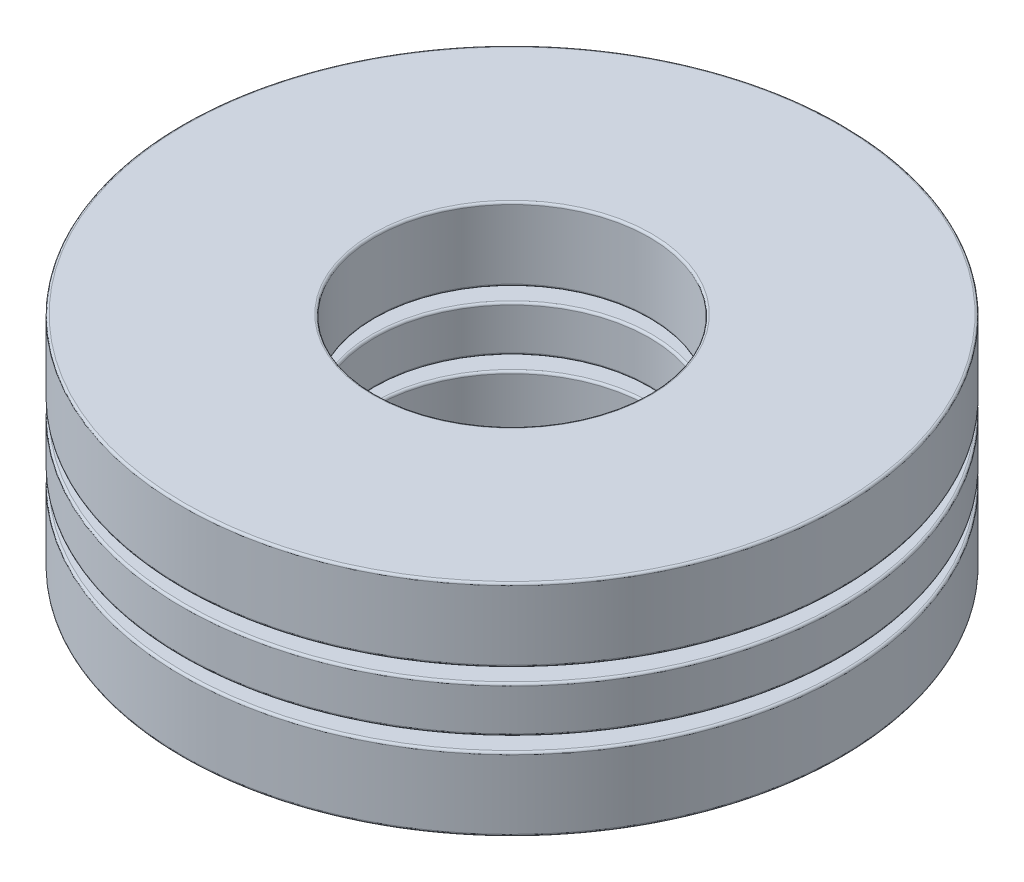
ISO-10303-21;
HEADER;
FILE_DESCRIPTION(('STEP AP214'),'2;1');
FILE_NAME('part.step','',(''),(''),'','','');
FILE_SCHEMA(('AUTOMOTIVE_DESIGN { 1 0 10303 214 1 1 1 1 }'));
ENDSEC;
DATA;
#1=APPLICATION_CONTEXT('core data for automotive mechanical design processes');
#2=APPLICATION_PROTOCOL_DEFINITION('international standard','automotive_design',2000,#1);
#3=PRODUCT_CONTEXT('',#1,'mechanical');
#4=PRODUCT('Part','Part','',(#3));
#5=PRODUCT_RELATED_PRODUCT_CATEGORY('part','',(#4));
#6=PRODUCT_DEFINITION_FORMATION('','',#4);
#7=PRODUCT_DEFINITION_CONTEXT('part definition',#1,'design');
#8=PRODUCT_DEFINITION('design','',#6,#7);
#9=PRODUCT_DEFINITION_SHAPE('','',#8);
#10=(LENGTH_UNIT() NAMED_UNIT(*) SI_UNIT(.MILLI.,.METRE.));
#11=(NAMED_UNIT(*) PLANE_ANGLE_UNIT() SI_UNIT($,.RADIAN.));
#12=(NAMED_UNIT(*) SI_UNIT($,.STERADIAN.) SOLID_ANGLE_UNIT());
#13=UNCERTAINTY_MEASURE_WITH_UNIT(LENGTH_MEASURE(1.E-05),#10,'distance_accuracy_value','');
#14=(GEOMETRIC_REPRESENTATION_CONTEXT(3) GLOBAL_UNCERTAINTY_ASSIGNED_CONTEXT((#13)) GLOBAL_UNIT_ASSIGNED_CONTEXT((#10,
#11,#12)) REPRESENTATION_CONTEXT('',''));
#15=CARTESIAN_POINT('',(0.,0.,0.));
#16=DIRECTION('',(0.,0.,1.));
#17=DIRECTION('',(1.,0.,0.));
#18=AXIS2_PLACEMENT_3D('',#15,#16,#17);
#19=CARTESIAN_POINT('',(-3.6806079660839,0.66666666708388,-2.12499999999994));
#20=CARTESIAN_POINT('',(-2.52590742712729,0.66666666708388,-1.45833333299996));
#21=CARTESIAN_POINT('',(-2.52590742712729,-0.666666666916121,-1.45833333299996));
#22=CARTESIAN_POINT('',(-3.6806079660839,-0.666666666916121,-2.12499999999994));
#23=(BOUNDED_CURVE() B_SPLINE_CURVE(3,(#19,#20,#21,#22),.UNSPECIFIED.,.F.,
.F.) B_SPLINE_CURVE_WITH_KNOTS((4,4),(0.,1.),
.UNSPECIFIED.) CURVE() GEOMETRIC_REPRESENTATION_ITEM() RATIONAL_B_SPLINE_CURVE((1.,
0.333333333333333,0.333333333333333,1.)) REPRESENTATION_ITEM(''));
#24=CARTESIAN_POINT('',(-3.680607966,0.,-2.125));
#25=DIRECTION('',(0.,1.,0.));
#26=AXIS1_PLACEMENT('',#24,#25);
#27=SURFACE_OF_REVOLUTION('',#23,#26);
#28=CARTESIAN_POINT('',(-3.680607966,-0.666666666916121,-2.125));
#29=VERTEX_POINT('',#28);
#30=VERTEX_LOOP('',#29);
#31=FACE_BOUND('',#30,.T.);
#32=CARTESIAN_POINT('',(-3.680607966,0.66666666708388,-2.125));
#33=VERTEX_POINT('',#32);
#34=VERTEX_LOOP('',#33);
#35=FACE_BOUND('',#34,.T.);
#36=ADVANCED_FACE('P0_F15',(#31,#35),#27,.F.);
#37=CLOSED_SHELL('',(#36));
#38=MANIFOLD_SOLID_BREP('P0_B1',#37);
#39=CARTESIAN_POINT('',(3.68060796608386,0.66666666691614,-2.125));
#40=CARTESIAN_POINT('',(2.52590742712726,0.66666666691614,-1.458333333));
#41=CARTESIAN_POINT('',(2.52590742712726,-0.666666667083859,-1.458333333));
#42=CARTESIAN_POINT('',(3.68060796608386,-0.666666667083859,-2.125));
#43=(BOUNDED_CURVE() B_SPLINE_CURVE(3,(#39,#40,#41,#42),.UNSPECIFIED.,.F.,
.F.) B_SPLINE_CURVE_WITH_KNOTS((4,4),(0.,1.),
.UNSPECIFIED.) CURVE() GEOMETRIC_REPRESENTATION_ITEM() RATIONAL_B_SPLINE_CURVE((1.,
0.333333333333333,0.333333333333333,1.)) REPRESENTATION_ITEM(''));
#44=CARTESIAN_POINT('',(3.680607966,0.,-2.125));
#45=DIRECTION('',(0.,1.,0.));
#46=AXIS1_PLACEMENT('',#44,#45);
#47=SURFACE_OF_REVOLUTION('',#43,#46);
#48=CARTESIAN_POINT('',(3.680607966,-0.666666667083859,-2.125));
#49=VERTEX_POINT('',#48);
#50=VERTEX_LOOP('',#49);
#51=FACE_BOUND('',#50,.T.);
#52=CARTESIAN_POINT('',(3.680607966,0.66666666691614,-2.125));
#53=VERTEX_POINT('',#52);
#54=VERTEX_LOOP('',#53);
#55=FACE_BOUND('',#54,.T.);
#56=ADVANCED_FACE('P1_F15',(#51,#55),#47,.F.);
#57=CLOSED_SHELL('',(#56));
#58=MANIFOLD_SOLID_BREP('P1_B1',#57);
#59=CARTESIAN_POINT('',(0.,0.666666667,4.25));
#60=CARTESIAN_POINT('',(0.,0.666666667,2.916666666));
#61=CARTESIAN_POINT('',(0.,-0.666666667,2.916666666));
#62=CARTESIAN_POINT('',(0.,-0.666666667,4.25));
#63=(BOUNDED_CURVE() B_SPLINE_CURVE(3,(#59,#60,#61,#62),.UNSPECIFIED.,.F.,
.F.) B_SPLINE_CURVE_WITH_KNOTS((4,4),(0.,1.),
.UNSPECIFIED.) CURVE() GEOMETRIC_REPRESENTATION_ITEM() RATIONAL_B_SPLINE_CURVE((1.,
0.333333333333333,0.333333333333333,1.)) REPRESENTATION_ITEM(''));
#64=CARTESIAN_POINT('',(0.,0.,4.25));
#65=DIRECTION('',(0.,1.,0.));
#66=AXIS1_PLACEMENT('',#64,#65);
#67=SURFACE_OF_REVOLUTION('',#63,#66);
#68=CARTESIAN_POINT('',(0.,-0.666666667,4.25));
#69=VERTEX_POINT('',#68);
#70=VERTEX_LOOP('',#69);
#71=FACE_BOUND('',#70,.T.);
#72=CARTESIAN_POINT('',(0.,0.666666667,4.25));
#73=VERTEX_POINT('',#72);
#74=VERTEX_LOOP('',#73);
#75=FACE_BOUND('',#74,.T.);
#76=ADVANCED_FACE('P2_F15',(#71,#75),#67,.F.);
#77=CLOSED_SHELL('',(#76));
#78=MANIFOLD_SOLID_BREP('P2_B1',#77);
#79=CARTESIAN_POINT('',(0.,-2.,2.54));
#80=CARTESIAN_POINT('',(0.,-2.,2.51656854249492));
#81=CARTESIAN_POINT('',(0.,-1.98343145750507,2.5));
#82=CARTESIAN_POINT('',(0.,-1.96,2.5));
#83=(BOUNDED_CURVE() B_SPLINE_CURVE(3,(#79,#80,#81,#82),.UNSPECIFIED.,.F.,
.F.) B_SPLINE_CURVE_WITH_KNOTS((4,4),(0.,1.),
.UNSPECIFIED.) CURVE() GEOMETRIC_REPRESENTATION_ITEM() RATIONAL_B_SPLINE_CURVE((1.,
0.804737854124367,0.804737854124367,1.)) REPRESENTATION_ITEM(''));
#84=CARTESIAN_POINT('',(0.,-1.96,0.));
#85=DIRECTION('',(0.,1.,0.));
#86=AXIS1_PLACEMENT('',#84,#85);
#87=SURFACE_OF_REVOLUTION('',#83,#86);
#88=CARTESIAN_POINT('',(0.,-1.96,0.));
#89=DIRECTION('',(0.,-1.,0.));
#90=DIRECTION('',(0.,0.,-1.));
#91=AXIS2_PLACEMENT_3D('',#88,#89,#90);
#92=CIRCLE('',#91,2.5);
#93=CARTESIAN_POINT('',(0.,-1.96,-2.5));
#94=VERTEX_POINT('',#93);
#95=EDGE_CURVE('P3_E221',#94,#94,#92,.T.);
#96=ORIENTED_EDGE('',*,*,#95,.F.);
#97=EDGE_LOOP('',(#96));
#98=FACE_BOUND('',#97,.T.);
#99=CARTESIAN_POINT('',(0.,-2.,0.));
#100=DIRECTION('',(0.,-1.,0.));
#101=DIRECTION('',(0.,0.,1.));
#102=AXIS2_PLACEMENT_3D('',#99,#100,#101);
#103=CIRCLE('',#102,2.54);
#104=CARTESIAN_POINT('',(0.,-2.,-2.54));
#105=VERTEX_POINT('',#104);
#106=CARTESIAN_POINT('',(0.,-2.,2.54));
#107=VERTEX_POINT('',#106);
#108=EDGE_CURVE('P3_E161',#105,#107,#103,.F.);
#109=ORIENTED_EDGE('',*,*,#108,.F.);
#110=CARTESIAN_POINT('',(0.,-2.,0.));
#111=DIRECTION('',(0.,-1.,0.));
#112=DIRECTION('',(0.,0.,-1.));
#113=AXIS2_PLACEMENT_3D('',#110,#111,#112);
#114=CIRCLE('',#113,2.54);
#115=EDGE_CURVE('P3_E152',#107,#105,#114,.F.);
#116=ORIENTED_EDGE('',*,*,#115,.F.);
#117=EDGE_LOOP('',(#109,#116));
#118=FACE_BOUND('',#117,.T.);
#119=ADVANCED_FACE('P3_F16',(#98,#118),#87,.F.);
#120=CARTESIAN_POINT('',(0.,-0.706666667,0.));
#121=DIRECTION('',(0.,-1.,0.));
#122=DIRECTION('',(0.,0.,-1.));
#123=AXIS2_PLACEMENT_3D('',#120,#121,#122);
#124=CYLINDRICAL_SURFACE('',#123,2.5);
#125=ORIENTED_EDGE('',*,*,#95,.T.);
#126=EDGE_LOOP('',(#125));
#127=FACE_BOUND('',#126,.T.);
#128=CARTESIAN_POINT('',(0.,-0.706666666666667,0.));
#129=DIRECTION('',(0.,-1.,0.));
#130=DIRECTION('',(0.,0.,-1.));
#131=AXIS2_PLACEMENT_3D('',#128,#129,#130);
#132=CIRCLE('',#131,2.50000000033333);
#133=CARTESIAN_POINT('',(0.,-0.706666666666667,-2.50000000033333));
#134=VERTEX_POINT('',#133);
#135=EDGE_CURVE('P3_E167',#134,#134,#132,.T.);
#136=ORIENTED_EDGE('',*,*,#135,.F.);
#137=EDGE_LOOP('',(#136));
#138=FACE_BOUND('',#137,.T.);
#139=ADVANCED_FACE('P3_F184',(#127,#138),#124,.F.);
#140=CARTESIAN_POINT('',(0.,-2.,6.));
#141=DIRECTION('',(0.,1.,0.));
#142=DIRECTION('',(0.,0.,1.));
#143=AXIS2_PLACEMENT_3D('',#140,#141,#142);
#144=PLANE('',#143);
#145=ORIENTED_EDGE('',*,*,#115,.T.);
#146=ORIENTED_EDGE('',*,*,#108,.T.);
#147=EDGE_LOOP('',(#145,#146));
#148=FACE_BOUND('',#147,.T.);
#149=CARTESIAN_POINT('',(0.,-2.,0.));
#150=DIRECTION('',(0.,1.,0.));
#151=DIRECTION('',(0.,0.,-1.));
#152=AXIS2_PLACEMENT_3D('',#149,#150,#151);
#153=CIRCLE('',#152,5.96);
#154=CARTESIAN_POINT('',(0.,-2.,5.96));
#155=VERTEX_POINT('',#154);
#156=CARTESIAN_POINT('',(0.,-2.,-5.96));
#157=VERTEX_POINT('',#156);
#158=EDGE_CURVE('P3_E55',#155,#157,#153,.F.);
#159=ORIENTED_EDGE('',*,*,#158,.T.);
#160=CARTESIAN_POINT('',(0.,-2.,0.));
#161=DIRECTION('',(0.,1.,0.));
#162=DIRECTION('',(0.,0.,1.));
#163=AXIS2_PLACEMENT_3D('',#160,#161,#162);
#164=CIRCLE('',#163,5.96);
#165=EDGE_CURVE('P3_E201',#155,#157,#164,.T.);
#166=ORIENTED_EDGE('',*,*,#165,.F.);
#167=EDGE_LOOP('',(#159,#166));
#168=FACE_BOUND('',#167,.T.);
#169=ADVANCED_FACE('P3_F166',(#148,#168),#144,.F.);
#170=CARTESIAN_POINT('',(0.,-0.666666666666667,-2.54000000033333));
#171=CARTESIAN_POINT('',(0.,-0.666666666666667,-2.51656854282825));
#172=CARTESIAN_POINT('',(0.,-0.683235209161591,-2.50000000033333));
#173=CARTESIAN_POINT('',(0.,-0.706666666666667,-2.50000000033333));
#174=(BOUNDED_CURVE() B_SPLINE_CURVE(3,(#170,#171,#172,#173),.UNSPECIFIED.,.F.,
.F.) B_SPLINE_CURVE_WITH_KNOTS((4,4),(0.,1.),
.UNSPECIFIED.) CURVE() GEOMETRIC_REPRESENTATION_ITEM() RATIONAL_B_SPLINE_CURVE((1.,
0.804737854124365,0.804737854124365,1.)) REPRESENTATION_ITEM(''));
#175=CARTESIAN_POINT('',(0.,-0.706666667,0.));
#176=DIRECTION('',(0.,-1.,0.));
#177=AXIS1_PLACEMENT('',#175,#176);
#178=SURFACE_OF_REVOLUTION('',#174,#177);
#179=ORIENTED_EDGE('',*,*,#135,.T.);
#180=EDGE_LOOP('',(#179));
#181=FACE_BOUND('',#180,.T.);
#182=CARTESIAN_POINT('',(0.,-0.666666666666667,0.));
#183=DIRECTION('',(0.,1.,0.));
#184=DIRECTION('',(0.,0.,-1.));
#185=AXIS2_PLACEMENT_3D('',#182,#183,#184);
#186=CIRCLE('',#185,2.54000000016666);
#187=CARTESIAN_POINT('',(0.,-0.6666666668,2.5400000001));
#188=VERTEX_POINT('',#187);
#189=CARTESIAN_POINT('',(0.,-0.6666666668,-2.5400000001));
#190=VERTEX_POINT('',#189);
#191=EDGE_CURVE('P3_E68',#188,#190,#186,.F.);
#192=ORIENTED_EDGE('',*,*,#191,.F.);
#193=CARTESIAN_POINT('',(0.,-0.666666666666667,0.));
#194=DIRECTION('',(0.,1.,0.));
#195=DIRECTION('',(0.,0.,1.));
#196=AXIS2_PLACEMENT_3D('',#193,#194,#195);
#197=CIRCLE('',#196,2.54000000016666);
#198=EDGE_CURVE('P3_E65',#190,#188,#197,.F.);
#199=ORIENTED_EDGE('',*,*,#198,.F.);
#200=EDGE_LOOP('',(#192,#199));
#201=FACE_BOUND('',#200,.T.);
#202=ADVANCED_FACE('P3_F70',(#181,#201),#178,.F.);
#203=CARTESIAN_POINT('',(0.,-1.96,6.));
#204=CARTESIAN_POINT('',(0.,-1.98343145750508,6.));
#205=CARTESIAN_POINT('',(0.,-2.,5.98343145750508));
#206=CARTESIAN_POINT('',(0.,-2.,5.96));
#207=(BOUNDED_CURVE() B_SPLINE_CURVE(3,(#203,#204,#205,#206),.UNSPECIFIED.,.F.,
.F.) B_SPLINE_CURVE_WITH_KNOTS((4,4),(0.,1.),
.UNSPECIFIED.) CURVE() GEOMETRIC_REPRESENTATION_ITEM() RATIONAL_B_SPLINE_CURVE((1.,
0.804737854124367,0.804737854124367,1.)) REPRESENTATION_ITEM(''));
#208=CARTESIAN_POINT('',(0.,-1.96,0.));
#209=DIRECTION('',(0.,1.,0.));
#210=AXIS1_PLACEMENT('',#208,#209);
#211=SURFACE_OF_REVOLUTION('',#207,#210);
#212=ORIENTED_EDGE('',*,*,#165,.T.);
#213=ORIENTED_EDGE('',*,*,#158,.F.);
#214=EDGE_LOOP('',(#212,#213));
#215=FACE_BOUND('',#214,.T.);
#216=CARTESIAN_POINT('',(0.,-1.96,0.));
#217=DIRECTION('',(0.,-1.,0.));
#218=DIRECTION('',(0.,0.,-1.));
#219=AXIS2_PLACEMENT_3D('',#216,#217,#218);
#220=CIRCLE('',#219,6.);
#221=CARTESIAN_POINT('',(0.,-1.96,-6.));
#222=VERTEX_POINT('',#221);
#223=EDGE_CURVE('P3_E73',#222,#222,#220,.F.);
#224=ORIENTED_EDGE('',*,*,#223,.F.);
#225=EDGE_LOOP('',(#224));
#226=FACE_BOUND('',#225,.T.);
#227=ADVANCED_FACE('P3_F96',(#215,#226),#211,.F.);
#228=CARTESIAN_POINT('',(0.,-0.666666667,6.));
#229=DIRECTION('',(0.,-1.,0.));
#230=DIRECTION('',(0.,0.,-1.));
#231=AXIS2_PLACEMENT_3D('',#228,#229,#230);
#232=PLANE('',#231);
#233=ORIENTED_EDGE('',*,*,#198,.T.);
#234=ORIENTED_EDGE('',*,*,#191,.T.);
#235=EDGE_LOOP('',(#233,#234));
#236=FACE_BOUND('',#235,.T.);
#237=CARTESIAN_POINT('',(0.,-0.666666667,0.));
#238=DIRECTION('',(0.,-1.,0.));
#239=DIRECTION('',(0.,0.,1.));
#240=AXIS2_PLACEMENT_3D('',#237,#238,#239);
#241=CIRCLE('',#240,5.96);
#242=CARTESIAN_POINT('',(0.,-0.666666667,-5.96));
#243=VERTEX_POINT('',#242);
#244=CARTESIAN_POINT('',(0.,-0.666666667,5.96));
#245=VERTEX_POINT('',#244);
#246=EDGE_CURVE('P3_E38',#243,#245,#241,.F.);
#247=ORIENTED_EDGE('',*,*,#246,.T.);
#248=CARTESIAN_POINT('',(0.,-0.666666667,0.));
#249=DIRECTION('',(0.,-1.,0.));
#250=DIRECTION('',(0.,0.,-1.));
#251=AXIS2_PLACEMENT_3D('',#248,#249,#250);
#252=CIRCLE('',#251,5.96);
#253=EDGE_CURVE('P3_E30',#243,#245,#252,.T.);
#254=ORIENTED_EDGE('',*,*,#253,.F.);
#255=EDGE_LOOP('',(#247,#254));
#256=FACE_BOUND('',#255,.T.);
#257=ADVANCED_FACE('P3_F77',(#236,#256),#232,.F.);
#258=CARTESIAN_POINT('',(0.,-1.96,0.));
#259=DIRECTION('',(0.,-1.,0.));
#260=DIRECTION('',(0.,0.,-1.));
#261=AXIS2_PLACEMENT_3D('',#258,#259,#260);
#262=CYLINDRICAL_SURFACE('',#261,6.);
#263=CARTESIAN_POINT('',(0.,-0.706666666666667,0.));
#264=DIRECTION('',(0.,-1.,0.));
#265=DIRECTION('',(0.,0.,-1.));
#266=AXIS2_PLACEMENT_3D('',#263,#264,#265);
#267=CIRCLE('',#266,6.);
#268=CARTESIAN_POINT('',(0.,-0.706666666666667,-6.));
#269=VERTEX_POINT('',#268);
#270=EDGE_CURVE('P3_E11',#269,#269,#267,.F.);
#271=ORIENTED_EDGE('',*,*,#270,.F.);
#272=EDGE_LOOP('',(#271));
#273=FACE_BOUND('',#272,.T.);
#274=ORIENTED_EDGE('',*,*,#223,.T.);
#275=EDGE_LOOP('',(#274));
#276=FACE_BOUND('',#275,.T.);
#277=ADVANCED_FACE('P3_F95',(#273,#276),#262,.T.);
#278=CARTESIAN_POINT('',(0.,-0.706666667,-6.));
#279=CARTESIAN_POINT('',(0.,-0.683235209494924,-6.));
#280=CARTESIAN_POINT('',(0.,-0.666666667,-5.98343145750508));
#281=CARTESIAN_POINT('',(0.,-0.666666667,-5.96));
#282=(BOUNDED_CURVE() B_SPLINE_CURVE(3,(#278,#279,#280,#281),.UNSPECIFIED.,.F.,
.F.) B_SPLINE_CURVE_WITH_KNOTS((4,4),(0.,1.),
.UNSPECIFIED.) CURVE() GEOMETRIC_REPRESENTATION_ITEM() RATIONAL_B_SPLINE_CURVE((1.,
0.804737854124365,0.804737854124365,1.)) REPRESENTATION_ITEM(''));
#283=CARTESIAN_POINT('',(0.,-0.706666667,0.));
#284=DIRECTION('',(0.,-1.,0.));
#285=AXIS1_PLACEMENT('',#283,#284);
#286=SURFACE_OF_REVOLUTION('',#282,#285);
#287=ORIENTED_EDGE('',*,*,#253,.T.);
#288=ORIENTED_EDGE('',*,*,#246,.F.);
#289=EDGE_LOOP('',(#287,#288));
#290=FACE_BOUND('',#289,.T.);
#291=ORIENTED_EDGE('',*,*,#270,.T.);
#292=EDGE_LOOP('',(#291));
#293=FACE_BOUND('',#292,.T.);
#294=ADVANCED_FACE('P3_F122',(#290,#293),#286,.F.);
#295=CLOSED_SHELL('',(#119,#139,#169,#202,#227,#257,#277,#294));
#296=MANIFOLD_SOLID_BREP('P3_B1',#295);
#297=CARTESIAN_POINT('',(0.,0.666666666666668,2.53999999966667));
#298=CARTESIAN_POINT('',(0.,0.666666666666668,2.51656854216159));
#299=CARTESIAN_POINT('',(0.,0.683235209161592,2.49999999966667));
#300=CARTESIAN_POINT('',(0.,0.706666666666668,2.49999999966667));
#301=(BOUNDED_CURVE() B_SPLINE_CURVE(3,(#297,#298,#299,#300),.UNSPECIFIED.,.F.,
.F.) B_SPLINE_CURVE_WITH_KNOTS((4,4),(0.,1.),
.UNSPECIFIED.) CURVE() GEOMETRIC_REPRESENTATION_ITEM() RATIONAL_B_SPLINE_CURVE((1.,
0.804737854124367,0.804737854124367,1.)) REPRESENTATION_ITEM(''));
#302=CARTESIAN_POINT('',(0.,0.706666667,0.));
#303=DIRECTION('',(0.,1.,0.));
#304=AXIS1_PLACEMENT('',#302,#303);
#305=SURFACE_OF_REVOLUTION('',#301,#304);
#306=CARTESIAN_POINT('',(0.,0.706666666666668,0.));
#307=DIRECTION('',(0.,-1.,0.));
#308=DIRECTION('',(0.,0.,-1.));
#309=AXIS2_PLACEMENT_3D('',#306,#307,#308);
#310=CIRCLE('',#309,2.5);
#311=CARTESIAN_POINT('',(0.,0.706666666666668,-2.5));
#312=VERTEX_POINT('',#311);
#313=EDGE_CURVE('P4_E227',#312,#312,#310,.T.);
#314=ORIENTED_EDGE('',*,*,#313,.F.);
#315=EDGE_LOOP('',(#314));
#316=FACE_BOUND('',#315,.T.);
#317=CARTESIAN_POINT('',(0.,0.666666666666668,0.));
#318=DIRECTION('',(0.,-1.,0.));
#319=DIRECTION('',(0.,0.,1.));
#320=AXIS2_PLACEMENT_3D('',#317,#318,#319);
#321=CIRCLE('',#320,2.53999999966667);
#322=CARTESIAN_POINT('',(0.,0.666666666800001,-2.53999999983334));
#323=VERTEX_POINT('',#322);
#324=CARTESIAN_POINT('',(0.,0.666666666800001,2.53999999983334));
#325=VERTEX_POINT('',#324);
#326=EDGE_CURVE('P4_E165',#323,#325,#321,.F.);
#327=ORIENTED_EDGE('',*,*,#326,.F.);
#328=CARTESIAN_POINT('',(0.,0.666666666666668,0.));
#329=DIRECTION('',(0.,-1.,0.));
#330=DIRECTION('',(0.,0.,-1.));
#331=AXIS2_PLACEMENT_3D('',#328,#329,#330);
#332=CIRCLE('',#331,2.53999999966667);
#333=EDGE_CURVE('P4_E156',#325,#323,#332,.F.);
#334=ORIENTED_EDGE('',*,*,#333,.F.);
#335=EDGE_LOOP('',(#327,#334));
#336=FACE_BOUND('',#335,.T.);
#337=ADVANCED_FACE('P4_F16',(#316,#336),#305,.F.);
#338=CARTESIAN_POINT('',(0.,1.96,0.));
#339=DIRECTION('',(0.,-1.,0.));
#340=DIRECTION('',(0.,0.,-1.));
#341=AXIS2_PLACEMENT_3D('',#338,#339,#340);
#342=CYLINDRICAL_SURFACE('',#341,2.5);
#343=ORIENTED_EDGE('',*,*,#313,.T.);
#344=EDGE_LOOP('',(#343));
#345=FACE_BOUND('',#344,.T.);
#346=CARTESIAN_POINT('',(0.,1.96,0.));
#347=DIRECTION('',(0.,-1.,0.));
#348=DIRECTION('',(0.,0.,-1.));
#349=AXIS2_PLACEMENT_3D('',#346,#347,#348);
#350=CIRCLE('',#349,2.5);
#351=CARTESIAN_POINT('',(0.,1.96,-2.5));
#352=VERTEX_POINT('',#351);
#353=EDGE_CURVE('P4_E172',#352,#352,#350,.T.);
#354=ORIENTED_EDGE('',*,*,#353,.F.);
#355=EDGE_LOOP('',(#354));
#356=FACE_BOUND('',#355,.T.);
#357=ADVANCED_FACE('P4_F189',(#345,#356),#342,.F.);
#358=CARTESIAN_POINT('',(0.,0.666666667,6.));
#359=DIRECTION('',(0.,1.,0.));
#360=DIRECTION('',(0.,0.,1.));
#361=AXIS2_PLACEMENT_3D('',#358,#359,#360);
#362=PLANE('',#361);
#363=ORIENTED_EDGE('',*,*,#333,.T.);
#364=ORIENTED_EDGE('',*,*,#326,.T.);
#365=EDGE_LOOP('',(#363,#364));
#366=FACE_BOUND('',#365,.T.);
#367=CARTESIAN_POINT('',(0.,0.66666666633334,0.));
#368=DIRECTION('',(0.,1.,0.));
#369=DIRECTION('',(0.,0.,-1.));
#370=AXIS2_PLACEMENT_3D('',#367,#368,#369);
#371=CIRCLE('',#370,5.96);
#372=CARTESIAN_POINT('',(0.,0.666666666600004,5.96));
#373=VERTEX_POINT('',#372);
#374=CARTESIAN_POINT('',(0.,0.666666666600004,-5.96));
#375=VERTEX_POINT('',#374);
#376=EDGE_CURVE('P4_E55',#373,#375,#371,.F.);
#377=ORIENTED_EDGE('',*,*,#376,.T.);
#378=CARTESIAN_POINT('',(0.,0.66666666633334,0.));
#379=DIRECTION('',(0.,1.,0.));
#380=DIRECTION('',(0.,0.,1.));
#381=AXIS2_PLACEMENT_3D('',#378,#379,#380);
#382=CIRCLE('',#381,5.96);
#383=EDGE_CURVE('P4_E206',#373,#375,#382,.T.);
#384=ORIENTED_EDGE('',*,*,#383,.F.);
#385=EDGE_LOOP('',(#377,#384));
#386=FACE_BOUND('',#385,.T.);
#387=ADVANCED_FACE('P4_F171',(#366,#386),#362,.F.);
#388=CARTESIAN_POINT('',(0.,2.,-2.54));
#389=CARTESIAN_POINT('',(0.,2.,-2.51656854249492));
#390=CARTESIAN_POINT('',(0.,1.98343145750508,-2.5));
#391=CARTESIAN_POINT('',(0.,1.96,-2.5));
#392=(BOUNDED_CURVE() B_SPLINE_CURVE(3,(#388,#389,#390,#391),.UNSPECIFIED.,.F.,
.F.) B_SPLINE_CURVE_WITH_KNOTS((4,4),(0.,1.),
.UNSPECIFIED.) CURVE() GEOMETRIC_REPRESENTATION_ITEM() RATIONAL_B_SPLINE_CURVE((1.,
0.804737854124365,0.804737854124365,1.)) REPRESENTATION_ITEM(''));
#393=CARTESIAN_POINT('',(0.,1.96,0.));
#394=DIRECTION('',(0.,-1.,0.));
#395=AXIS1_PLACEMENT('',#393,#394);
#396=SURFACE_OF_REVOLUTION('',#392,#395);
#397=ORIENTED_EDGE('',*,*,#353,.T.);
#398=EDGE_LOOP('',(#397));
#399=FACE_BOUND('',#398,.T.);
#400=CARTESIAN_POINT('',(0.,2.,0.));
#401=DIRECTION('',(0.,1.,0.));
#402=DIRECTION('',(0.,0.,-1.));
#403=AXIS2_PLACEMENT_3D('',#400,#401,#402);
#404=CIRCLE('',#403,2.54);
#405=CARTESIAN_POINT('',(0.,2.,2.54));
#406=VERTEX_POINT('',#405);
#407=CARTESIAN_POINT('',(0.,2.,-2.54));
#408=VERTEX_POINT('',#407);
#409=EDGE_CURVE('P4_E70',#406,#408,#404,.F.);
#410=ORIENTED_EDGE('',*,*,#409,.F.);
#411=CARTESIAN_POINT('',(0.,2.,0.));
#412=DIRECTION('',(0.,1.,0.));
#413=DIRECTION('',(0.,0.,1.));
#414=AXIS2_PLACEMENT_3D('',#411,#412,#413);
#415=CIRCLE('',#414,2.54);
#416=EDGE_CURVE('P4_E67',#408,#406,#415,.F.);
#417=ORIENTED_EDGE('',*,*,#416,.F.);
#418=EDGE_LOOP('',(#410,#417));
#419=FACE_BOUND('',#418,.T.);
#420=ADVANCED_FACE('P4_F72',(#399,#419),#396,.F.);
#421=CARTESIAN_POINT('',(0.,0.706666666333339,6.));
#422=CARTESIAN_POINT('',(0.,0.683235208828263,6.));
#423=CARTESIAN_POINT('',(0.,0.66666666633334,5.98343145750507));
#424=CARTESIAN_POINT('',(0.,0.66666666633334,5.96));
#425=(BOUNDED_CURVE() B_SPLINE_CURVE(3,(#421,#422,#423,#424),.UNSPECIFIED.,.F.,
.F.) B_SPLINE_CURVE_WITH_KNOTS((4,4),(0.,1.),
.UNSPECIFIED.) CURVE() GEOMETRIC_REPRESENTATION_ITEM() RATIONAL_B_SPLINE_CURVE((1.,
0.804737854124367,0.804737854124367,1.)) REPRESENTATION_ITEM(''));
#426=CARTESIAN_POINT('',(0.,0.706666667,0.));
#427=DIRECTION('',(0.,1.,0.));
#428=AXIS1_PLACEMENT('',#426,#427);
#429=SURFACE_OF_REVOLUTION('',#425,#428);
#430=ORIENTED_EDGE('',*,*,#383,.T.);
#431=ORIENTED_EDGE('',*,*,#376,.F.);
#432=EDGE_LOOP('',(#430,#431));
#433=FACE_BOUND('',#432,.T.);
#434=CARTESIAN_POINT('',(0.,0.706666666666668,0.));
#435=DIRECTION('',(0.,-1.,0.));
#436=DIRECTION('',(0.,0.,-1.));
#437=AXIS2_PLACEMENT_3D('',#434,#435,#436);
#438=CIRCLE('',#437,6.);
#439=CARTESIAN_POINT('',(0.,0.706666666666668,-6.));
#440=VERTEX_POINT('',#439);
#441=EDGE_CURVE('P4_E76',#440,#440,#438,.F.);
#442=ORIENTED_EDGE('',*,*,#441,.F.);
#443=EDGE_LOOP('',(#442));
#444=FACE_BOUND('',#443,.T.);
#445=ADVANCED_FACE('P4_F100',(#433,#444),#429,.F.);
#446=CARTESIAN_POINT('',(0.,2.,6.));
#447=DIRECTION('',(0.,-1.,0.));
#448=DIRECTION('',(0.,0.,-1.));
#449=AXIS2_PLACEMENT_3D('',#446,#447,#448);
#450=PLANE('',#449);
#451=ORIENTED_EDGE('',*,*,#416,.T.);
#452=ORIENTED_EDGE('',*,*,#409,.T.);
#453=EDGE_LOOP('',(#451,#452));
#454=FACE_BOUND('',#453,.T.);
#455=CARTESIAN_POINT('',(0.,2.,0.));
#456=DIRECTION('',(0.,-1.,0.));
#457=DIRECTION('',(0.,0.,1.));
#458=AXIS2_PLACEMENT_3D('',#455,#456,#457);
#459=CIRCLE('',#458,5.96);
#460=CARTESIAN_POINT('',(0.,2.,-5.96));
#461=VERTEX_POINT('',#460);
#462=CARTESIAN_POINT('',(0.,2.,5.96));
#463=VERTEX_POINT('',#462);
#464=EDGE_CURVE('P4_E38',#461,#463,#459,.F.);
#465=ORIENTED_EDGE('',*,*,#464,.T.);
#466=CARTESIAN_POINT('',(0.,2.,0.));
#467=DIRECTION('',(0.,-1.,0.));
#468=DIRECTION('',(0.,0.,-1.));
#469=AXIS2_PLACEMENT_3D('',#466,#467,#468);
#470=CIRCLE('',#469,5.96);
#471=EDGE_CURVE('P4_E30',#461,#463,#470,.T.);
#472=ORIENTED_EDGE('',*,*,#471,.F.);
#473=EDGE_LOOP('',(#465,#472));
#474=FACE_BOUND('',#473,.T.);
#475=ADVANCED_FACE('P4_F80',(#454,#474),#450,.F.);
#476=CARTESIAN_POINT('',(0.,0.706666667,0.));
#477=DIRECTION('',(0.,-1.,0.));
#478=DIRECTION('',(0.,0.,-1.));
#479=AXIS2_PLACEMENT_3D('',#476,#477,#478);
#480=CYLINDRICAL_SURFACE('',#479,6.);
#481=CARTESIAN_POINT('',(0.,1.96,0.));
#482=DIRECTION('',(0.,-1.,0.));
#483=DIRECTION('',(0.,0.,-1.));
#484=AXIS2_PLACEMENT_3D('',#481,#482,#483);
#485=CIRCLE('',#484,6.);
#486=CARTESIAN_POINT('',(0.,1.96,-6.));
#487=VERTEX_POINT('',#486);
#488=EDGE_CURVE('P4_E11',#487,#487,#485,.F.);
#489=ORIENTED_EDGE('',*,*,#488,.F.);
#490=EDGE_LOOP('',(#489));
#491=FACE_BOUND('',#490,.T.);
#492=ORIENTED_EDGE('',*,*,#441,.T.);
#493=EDGE_LOOP('',(#492));
#494=FACE_BOUND('',#493,.T.);
#495=ADVANCED_FACE('P4_F99',(#491,#494),#480,.T.);
#496=CARTESIAN_POINT('',(0.,1.96,-6.));
#497=CARTESIAN_POINT('',(0.,1.98343145750508,-6.));
#498=CARTESIAN_POINT('',(0.,2.,-5.98343145750508));
#499=CARTESIAN_POINT('',(0.,2.,-5.96));
#500=(BOUNDED_CURVE() B_SPLINE_CURVE(3,(#496,#497,#498,#499),.UNSPECIFIED.,.F.,
.F.) B_SPLINE_CURVE_WITH_KNOTS((4,4),(0.,1.),
.UNSPECIFIED.) CURVE() GEOMETRIC_REPRESENTATION_ITEM() RATIONAL_B_SPLINE_CURVE((1.,
0.804737854124365,0.804737854124365,1.)) REPRESENTATION_ITEM(''));
#501=CARTESIAN_POINT('',(0.,1.96,0.));
#502=DIRECTION('',(0.,-1.,0.));
#503=AXIS1_PLACEMENT('',#501,#502);
#504=SURFACE_OF_REVOLUTION('',#500,#503);
#505=ORIENTED_EDGE('',*,*,#471,.T.);
#506=ORIENTED_EDGE('',*,*,#464,.F.);
#507=EDGE_LOOP('',(#505,#506));
#508=FACE_BOUND('',#507,.T.);
#509=ORIENTED_EDGE('',*,*,#488,.T.);
#510=EDGE_LOOP('',(#509));
#511=FACE_BOUND('',#510,.T.);
#512=ADVANCED_FACE('P4_F126',(#508,#511),#504,.F.);
#513=CLOSED_SHELL('',(#337,#357,#387,#420,#445,#475,#495,#512));
#514=MANIFOLD_SOLID_BREP('P4_B1',#513);
#515=CARTESIAN_POINT('',(0.,-0.416666666666667,2.54000000033333));
#516=CARTESIAN_POINT('',(0.,-0.416666666666667,2.51656854282825));
#517=CARTESIAN_POINT('',(0.,-0.400098124171743,2.50000000033333));
#518=CARTESIAN_POINT('',(0.,-0.376666666666667,2.50000000033333));
#519=(BOUNDED_CURVE() B_SPLINE_CURVE(3,(#515,#516,#517,#518),.UNSPECIFIED.,.F.,
.F.) B_SPLINE_CURVE_WITH_KNOTS((4,4),(0.,1.),
.UNSPECIFIED.) CURVE() GEOMETRIC_REPRESENTATION_ITEM() RATIONAL_B_SPLINE_CURVE((1.,
0.804737854124367,0.804737854124367,1.)) REPRESENTATION_ITEM(''));
#520=CARTESIAN_POINT('',(0.,-0.376666667,0.));
#521=DIRECTION('',(0.,1.,0.));
#522=AXIS1_PLACEMENT('',#520,#521);
#523=SURFACE_OF_REVOLUTION('',#519,#522);
#524=CARTESIAN_POINT('',(0.,-0.376666666666667,0.));
#525=DIRECTION('',(0.,-1.,0.));
#526=DIRECTION('',(0.,0.,-1.));
#527=AXIS2_PLACEMENT_3D('',#524,#525,#526);
#528=CIRCLE('',#527,2.5);
#529=CARTESIAN_POINT('',(0.,-0.376666666666667,-2.5));
#530=VERTEX_POINT('',#529);
#531=EDGE_CURVE('P5_E251',#530,#530,#528,.T.);
#532=ORIENTED_EDGE('',*,*,#531,.F.);
#533=EDGE_LOOP('',(#532));
#534=FACE_BOUND('',#533,.T.);
#535=CARTESIAN_POINT('',(0.,-0.416666666666667,0.));
#536=DIRECTION('',(0.,-1.,0.));
#537=DIRECTION('',(0.,0.,1.));
#538=AXIS2_PLACEMENT_3D('',#535,#536,#537);
#539=CIRCLE('',#538,2.54000000016666);
#540=CARTESIAN_POINT('',(0.,-0.416666666800001,-2.5400000001));
#541=VERTEX_POINT('',#540);
#542=CARTESIAN_POINT('',(0.,-0.416666666800001,2.5400000001));
#543=VERTEX_POINT('',#542);
#544=EDGE_CURVE('P5_E164',#541,#543,#539,.F.);
#545=ORIENTED_EDGE('',*,*,#544,.F.);
#546=CARTESIAN_POINT('',(0.,-0.416666666666667,0.));
#547=DIRECTION('',(0.,-1.,0.));
#548=DIRECTION('',(0.,0.,-1.));
#549=AXIS2_PLACEMENT_3D('',#546,#547,#548);
#550=CIRCLE('',#549,2.54000000016666);
#551=EDGE_CURVE('P5_E155',#543,#541,#550,.F.);
#552=ORIENTED_EDGE('',*,*,#551,.F.);
#553=EDGE_LOOP('',(#545,#552));
#554=FACE_BOUND('',#553,.T.);
#555=ADVANCED_FACE('P5_F16',(#534,#554),#523,.F.);
#556=CARTESIAN_POINT('',(0.,0.376666667,0.));
#557=DIRECTION('',(0.,-1.,0.));
#558=DIRECTION('',(0.,0.,-1.));
#559=AXIS2_PLACEMENT_3D('',#556,#557,#558);
#560=CYLINDRICAL_SURFACE('',#559,2.5);
#561=ORIENTED_EDGE('',*,*,#531,.T.);
#562=EDGE_LOOP('',(#561));
#563=FACE_BOUND('',#562,.T.);
#564=CARTESIAN_POINT('',(0.,0.376666666666666,0.));
#565=DIRECTION('',(0.,-1.,0.));
#566=DIRECTION('',(0.,0.,-1.));
#567=AXIS2_PLACEMENT_3D('',#564,#565,#566);
#568=CIRCLE('',#567,2.49999999966667);
#569=CARTESIAN_POINT('',(0.,0.376666666666666,-2.49999999966667));
#570=VERTEX_POINT('',#569);
#571=EDGE_CURVE('P5_E170',#570,#570,#568,.T.);
#572=ORIENTED_EDGE('',*,*,#571,.F.);
#573=EDGE_LOOP('',(#572));
#574=FACE_BOUND('',#573,.T.);
#575=ADVANCED_FACE('P5_F188',(#563,#574),#560,.F.);
#576=CARTESIAN_POINT('',(0.,-0.416666667,6.));
#577=DIRECTION('',(0.,1.,0.));
#578=DIRECTION('',(0.,0.,1.));
#579=AXIS2_PLACEMENT_3D('',#576,#577,#578);
#580=PLANE('',#579);
#581=CARTESIAN_POINT('',(0.,-0.416666667,4.25));
#582=DIRECTION('',(0.,1.,0.));
#583=DIRECTION('',(0.,0.,1.));
#584=AXIS2_PLACEMENT_3D('',#581,#582,#583);
#585=CIRCLE('',#584,0.520416500026661);
#586=CARTESIAN_POINT('',(0.,-0.416666667,4.77041650002666));
#587=VERTEX_POINT('',#586);
#588=EDGE_CURVE('P5_E209',#587,#587,#585,.F.);
#589=ORIENTED_EDGE('',*,*,#588,.F.);
#590=EDGE_LOOP('',(#589));
#591=FACE_BOUND('',#590,.T.);
#592=CARTESIAN_POINT('',(3.680607966,-0.416666667,-2.125));
#593=DIRECTION('',(0.,1.,0.));
#594=DIRECTION('',(0.,0.,1.));
#595=AXIS2_PLACEMENT_3D('',#592,#593,#594);
#596=CIRCLE('',#595,0.520416499886887);
#597=CARTESIAN_POINT('',(3.680607966,-0.416666667,-1.60458350011311));
#598=VERTEX_POINT('',#597);
#599=EDGE_CURVE('P5_E214',#598,#598,#596,.F.);
#600=ORIENTED_EDGE('',*,*,#599,.F.);
#601=EDGE_LOOP('',(#600));
#602=FACE_BOUND('',#601,.T.);
#603=CARTESIAN_POINT('',(-3.680607966,-0.416666667,-2.125));
#604=DIRECTION('',(0.,1.,0.));
#605=DIRECTION('',(0.,0.,1.));
#606=AXIS2_PLACEMENT_3D('',#603,#604,#605);
#607=CIRCLE('',#606,0.520416500021188);
#608=CARTESIAN_POINT('',(-3.680607966,-0.416666667,-1.60458349997881));
#609=VERTEX_POINT('',#608);
#610=EDGE_CURVE('P5_E220',#609,#609,#607,.F.);
#611=ORIENTED_EDGE('',*,*,#610,.F.);
#612=EDGE_LOOP('',(#611));
#613=FACE_BOUND('',#612,.T.);
#614=ORIENTED_EDGE('',*,*,#551,.T.);
#615=ORIENTED_EDGE('',*,*,#544,.T.);
#616=EDGE_LOOP('',(#614,#615));
#617=FACE_BOUND('',#616,.T.);
#618=CARTESIAN_POINT('',(0.,-0.416666666333335,0.));
#619=DIRECTION('',(0.,1.,0.));
#620=DIRECTION('',(0.,0.,-1.));
#621=AXIS2_PLACEMENT_3D('',#618,#619,#620);
#622=CIRCLE('',#621,5.96);
#623=CARTESIAN_POINT('',(0.,-0.416666666600001,5.96));
#624=VERTEX_POINT('',#623);
#625=CARTESIAN_POINT('',(0.,-0.416666666600001,-5.96));
#626=VERTEX_POINT('',#625);
#627=EDGE_CURVE('P5_E55',#624,#626,#622,.F.);
#628=ORIENTED_EDGE('',*,*,#627,.T.);
#629=CARTESIAN_POINT('',(0.,-0.416666666333335,0.));
#630=DIRECTION('',(0.,1.,0.));
#631=DIRECTION('',(0.,0.,1.));
#632=AXIS2_PLACEMENT_3D('',#629,#630,#631);
#633=CIRCLE('',#632,5.96);
#634=EDGE_CURVE('P5_E207',#624,#626,#633,.T.);
#635=ORIENTED_EDGE('',*,*,#634,.F.);
#636=EDGE_LOOP('',(#628,#635));
#637=FACE_BOUND('',#636,.T.);
#638=ADVANCED_FACE('P5_F169',(#591,#602,#613,#617,#637),#580,.F.);
#639=CARTESIAN_POINT('',(0.,0.416666666666666,-2.53999999966667));
#640=CARTESIAN_POINT('',(0.,0.416666666666666,-2.51656854216159));
#641=CARTESIAN_POINT('',(0.,0.400098124171742,-2.49999999966667));
#642=CARTESIAN_POINT('',(0.,0.376666666666666,-2.49999999966667));
#643=(BOUNDED_CURVE() B_SPLINE_CURVE(3,(#639,#640,#641,#642),.UNSPECIFIED.,.F.,
.F.) B_SPLINE_CURVE_WITH_KNOTS((4,4),(0.,1.),
.UNSPECIFIED.) CURVE() GEOMETRIC_REPRESENTATION_ITEM() RATIONAL_B_SPLINE_CURVE((1.,
0.804737854124365,0.804737854124365,1.)) REPRESENTATION_ITEM(''));
#644=CARTESIAN_POINT('',(0.,0.376666667,0.));
#645=DIRECTION('',(0.,-1.,0.));
#646=AXIS1_PLACEMENT('',#644,#645);
#647=SURFACE_OF_REVOLUTION('',#643,#646);
#648=ORIENTED_EDGE('',*,*,#571,.T.);
#649=EDGE_LOOP('',(#648));
#650=FACE_BOUND('',#649,.T.);
#651=CARTESIAN_POINT('',(0.,0.416666666666666,0.));
#652=DIRECTION('',(0.,1.,0.));
#653=DIRECTION('',(0.,0.,-1.));
#654=AXIS2_PLACEMENT_3D('',#651,#652,#653);
#655=CIRCLE('',#654,2.53999999966667);
#656=CARTESIAN_POINT('',(0.,0.4166666668,2.53999999983334));
#657=VERTEX_POINT('',#656);
#658=CARTESIAN_POINT('',(0.,0.4166666668,-2.53999999983334));
#659=VERTEX_POINT('',#658);
#660=EDGE_CURVE('P5_E68',#657,#659,#655,.F.);
#661=ORIENTED_EDGE('',*,*,#660,.F.);
#662=CARTESIAN_POINT('',(0.,0.416666666666666,0.));
#663=DIRECTION('',(0.,1.,0.));
#664=DIRECTION('',(0.,0.,1.));
#665=AXIS2_PLACEMENT_3D('',#662,#663,#664);
#666=CIRCLE('',#665,2.53999999966667);
#667=EDGE_CURVE('P5_E65',#659,#657,#666,.F.);
#668=ORIENTED_EDGE('',*,*,#667,.F.);
#669=EDGE_LOOP('',(#661,#668));
#670=FACE_BOUND('',#669,.T.);
#671=ADVANCED_FACE('P5_F70',(#650,#670),#647,.F.);
#672=CARTESIAN_POINT('',(-3.68060796608386,-0.66666666708388,-2.12499999999999));
#673=CARTESIAN_POINT('',(-2.52590742712726,-0.666666667083861,-1.458333333));
#674=CARTESIAN_POINT('',(-2.52590742712727,0.666666666916139,-1.45833333300001));
#675=CARTESIAN_POINT('',(-3.68060796608388,0.666666666916121,-2.125));
#676=(BOUNDED_CURVE() B_SPLINE_CURVE(3,(#672,#673,#674,#675),.UNSPECIFIED.,.F.,
.F.) B_SPLINE_CURVE_WITH_KNOTS((4,4),(0.,1.),
.UNSPECIFIED.) CURVE() GEOMETRIC_REPRESENTATION_ITEM() RATIONAL_B_SPLINE_CURVE((1.,
0.333333333333334,0.333333333333334,1.)) REPRESENTATION_ITEM(''));
#677=CARTESIAN_POINT('',(-3.680607966,0.,-2.125));
#678=DIRECTION('',(0.,1.,0.));
#679=AXIS1_PLACEMENT('',#677,#678);
#680=SURFACE_OF_REVOLUTION('',#676,#679);
#681=ORIENTED_EDGE('',*,*,#610,.T.);
#682=EDGE_LOOP('',(#681));
#683=FACE_BOUND('',#682,.T.);
#684=CARTESIAN_POINT('',(-3.680607966,0.416666667,-2.125));
#685=DIRECTION('',(0.,1.,0.));
#686=DIRECTION('',(0.,0.,1.));
#687=AXIS2_PLACEMENT_3D('',#684,#685,#686);
#688=CIRCLE('',#687,0.520416499886872);
#689=CARTESIAN_POINT('',(-3.680607966,0.416666667,-1.60458350011313));
#690=VERTEX_POINT('',#689);
#691=EDGE_CURVE('P5_E73',#690,#690,#688,.F.);
#692=ORIENTED_EDGE('',*,*,#691,.F.);
#693=EDGE_LOOP('',(#692));
#694=FACE_BOUND('',#693,.T.);
#695=ADVANCED_FACE('P5_F273',(#683,#694),#680,.F.);
#696=CARTESIAN_POINT('',(3.68060796608384,-0.66666666691614,-2.12500000000002));
#697=CARTESIAN_POINT('',(2.52590742712724,-0.666666666916121,-1.45833333300003));
#698=CARTESIAN_POINT('',(2.52590742712726,0.666666667083878,-1.45833333300004));
#699=CARTESIAN_POINT('',(3.68060796608386,0.666666667083859,-2.12500000000003));
#700=(BOUNDED_CURVE() B_SPLINE_CURVE(3,(#696,#697,#698,#699),.UNSPECIFIED.,.F.,
.F.) B_SPLINE_CURVE_WITH_KNOTS((4,4),(0.,1.),
.UNSPECIFIED.) CURVE() GEOMETRIC_REPRESENTATION_ITEM() RATIONAL_B_SPLINE_CURVE((1.,
0.333333333333333,0.333333333333333,1.)) REPRESENTATION_ITEM(''));
#701=CARTESIAN_POINT('',(3.680607966,0.,-2.125));
#702=DIRECTION('',(0.,1.,0.));
#703=AXIS1_PLACEMENT('',#701,#702);
#704=SURFACE_OF_REVOLUTION('',#700,#703);
#705=ORIENTED_EDGE('',*,*,#599,.T.);
#706=EDGE_LOOP('',(#705));
#707=FACE_BOUND('',#706,.T.);
#708=CARTESIAN_POINT('',(3.680607966,0.416666667,-2.125));
#709=DIRECTION('',(0.,1.,0.));
#710=DIRECTION('',(0.,0.,1.));
#711=AXIS2_PLACEMENT_3D('',#708,#709,#710);
#712=CIRCLE('',#711,0.520416500021169);
#713=CARTESIAN_POINT('',(3.680607966,0.416666667,-1.60458349997883));
#714=VERTEX_POINT('',#713);
#715=EDGE_CURVE('P5_E264',#714,#714,#712,.F.);
#716=ORIENTED_EDGE('',*,*,#715,.F.);
#717=EDGE_LOOP('',(#716));
#718=FACE_BOUND('',#717,.T.);
#719=ADVANCED_FACE('P5_F275',(#707,#718),#704,.F.);
#720=CARTESIAN_POINT('',(0.,-0.666666667,4.24999999999999));
#721=CARTESIAN_POINT('',(0.,-0.666666666999984,2.91666666599999));
#722=CARTESIAN_POINT('',(0.,0.666666667000019,2.91666666600001));
#723=CARTESIAN_POINT('',(0.,0.666666667,4.25000000000001));
#724=(BOUNDED_CURVE() B_SPLINE_CURVE(3,(#720,#721,#722,#723),.UNSPECIFIED.,.F.,
.F.) B_SPLINE_CURVE_WITH_KNOTS((4,4),(0.,1.),
.UNSPECIFIED.) CURVE() GEOMETRIC_REPRESENTATION_ITEM() RATIONAL_B_SPLINE_CURVE((1.,
0.333333333333333,0.333333333333333,1.)) REPRESENTATION_ITEM(''));
#725=CARTESIAN_POINT('',(0.,0.,4.25));
#726=DIRECTION('',(0.,1.,0.));
#727=AXIS1_PLACEMENT('',#725,#726);
#728=SURFACE_OF_REVOLUTION('',#724,#727);
#729=ORIENTED_EDGE('',*,*,#588,.T.);
#730=EDGE_LOOP('',(#729));
#731=FACE_BOUND('',#730,.T.);
#732=CARTESIAN_POINT('',(0.,0.416666667,4.25));
#733=DIRECTION('',(0.,1.,0.));
#734=DIRECTION('',(0.,0.,1.));
#735=AXIS2_PLACEMENT_3D('',#732,#733,#734);
#736=CIRCLE('',#735,0.520416500026661);
#737=CARTESIAN_POINT('',(0.,0.416666667,4.77041650002666));
#738=VERTEX_POINT('',#737);
#739=EDGE_CURVE('P5_E262',#738,#738,#736,.F.);
#740=ORIENTED_EDGE('',*,*,#739,.F.);
#741=EDGE_LOOP('',(#740));
#742=FACE_BOUND('',#741,.T.);
#743=ADVANCED_FACE('P5_F281',(#731,#742),#728,.F.);
#744=CARTESIAN_POINT('',(0.,-0.376666666333335,6.));
#745=CARTESIAN_POINT('',(0.,-0.400098123838411,6.));
#746=CARTESIAN_POINT('',(0.,-0.416666666333335,5.98343145750508));
#747=CARTESIAN_POINT('',(0.,-0.416666666333335,5.96));
#748=(BOUNDED_CURVE() B_SPLINE_CURVE(3,(#744,#745,#746,#747),.UNSPECIFIED.,.F.,
.F.) B_SPLINE_CURVE_WITH_KNOTS((4,4),(0.,1.),
.UNSPECIFIED.) CURVE() GEOMETRIC_REPRESENTATION_ITEM() RATIONAL_B_SPLINE_CURVE((1.,
0.804737854124367,0.804737854124367,1.)) REPRESENTATION_ITEM(''));
#749=CARTESIAN_POINT('',(0.,-0.376666667,0.));
#750=DIRECTION('',(0.,1.,0.));
#751=AXIS1_PLACEMENT('',#749,#750);
#752=SURFACE_OF_REVOLUTION('',#748,#751);
#753=ORIENTED_EDGE('',*,*,#634,.T.);
#754=ORIENTED_EDGE('',*,*,#627,.F.);
#755=EDGE_LOOP('',(#753,#754));
#756=FACE_BOUND('',#755,.T.);
#757=CARTESIAN_POINT('',(0.,-0.376666666666667,0.));
#758=DIRECTION('',(0.,-1.,0.));
#759=DIRECTION('',(0.,0.,-1.));
#760=AXIS2_PLACEMENT_3D('',#757,#758,#759);
#761=CIRCLE('',#760,6.);
#762=CARTESIAN_POINT('',(0.,-0.376666666666667,-6.));
#763=VERTEX_POINT('',#762);
#764=EDGE_CURVE('P5_E259',#763,#763,#761,.F.);
#765=ORIENTED_EDGE('',*,*,#764,.F.);
#766=EDGE_LOOP('',(#765));
#767=FACE_BOUND('',#766,.T.);
#768=ADVANCED_FACE('P5_F97',(#756,#767),#752,.F.);
#769=CARTESIAN_POINT('',(0.,0.416666667,6.));
#770=DIRECTION('',(0.,-1.,0.));
#771=DIRECTION('',(0.,0.,-1.));
#772=AXIS2_PLACEMENT_3D('',#769,#770,#771);
#773=PLANE('',#772);
#774=ORIENTED_EDGE('',*,*,#739,.T.);
#775=EDGE_LOOP('',(#774));
#776=FACE_BOUND('',#775,.T.);
#777=ORIENTED_EDGE('',*,*,#715,.T.);
#778=EDGE_LOOP('',(#777));
#779=FACE_BOUND('',#778,.T.);
#780=ORIENTED_EDGE('',*,*,#691,.T.);
#781=EDGE_LOOP('',(#780));
#782=FACE_BOUND('',#781,.T.);
#783=ORIENTED_EDGE('',*,*,#667,.T.);
#784=ORIENTED_EDGE('',*,*,#660,.T.);
#785=EDGE_LOOP('',(#783,#784));
#786=FACE_BOUND('',#785,.T.);
#787=CARTESIAN_POINT('',(0.,0.416666667,0.));
#788=DIRECTION('',(0.,-1.,0.));
#789=DIRECTION('',(0.,0.,1.));
#790=AXIS2_PLACEMENT_3D('',#787,#788,#789);
#791=CIRCLE('',#790,5.96);
#792=CARTESIAN_POINT('',(0.,0.416666667,-5.96));
#793=VERTEX_POINT('',#792);
#794=CARTESIAN_POINT('',(0.,0.416666667,5.96));
#795=VERTEX_POINT('',#794);
#796=EDGE_CURVE('P5_E38',#793,#795,#791,.F.);
#797=ORIENTED_EDGE('',*,*,#796,.T.);
#798=CARTESIAN_POINT('',(0.,0.416666667,0.));
#799=DIRECTION('',(0.,-1.,0.));
#800=DIRECTION('',(0.,0.,-1.));
#801=AXIS2_PLACEMENT_3D('',#798,#799,#800);
#802=CIRCLE('',#801,5.96);
#803=EDGE_CURVE('P5_E30',#793,#795,#802,.T.);
#804=ORIENTED_EDGE('',*,*,#803,.F.);
#805=EDGE_LOOP('',(#797,#804));
#806=FACE_BOUND('',#805,.T.);
#807=ADVANCED_FACE('P5_F77',(#776,#779,#782,#786,#806),#773,.F.);
#808=CARTESIAN_POINT('',(0.,-0.376666667,0.));
#809=DIRECTION('',(0.,-1.,0.));
#810=DIRECTION('',(0.,0.,-1.));
#811=AXIS2_PLACEMENT_3D('',#808,#809,#810);
#812=CYLINDRICAL_SURFACE('',#811,6.);
#813=CARTESIAN_POINT('',(0.,0.376666666666666,0.));
#814=DIRECTION('',(0.,-1.,0.));
#815=DIRECTION('',(0.,0.,-1.));
#816=AXIS2_PLACEMENT_3D('',#813,#814,#815);
#817=CIRCLE('',#816,6.);
#818=CARTESIAN_POINT('',(0.,0.376666666666666,-6.));
#819=VERTEX_POINT('',#818);
#820=EDGE_CURVE('P5_E11',#819,#819,#817,.F.);
#821=ORIENTED_EDGE('',*,*,#820,.F.);
#822=EDGE_LOOP('',(#821));
#823=FACE_BOUND('',#822,.T.);
#824=ORIENTED_EDGE('',*,*,#764,.T.);
#825=EDGE_LOOP('',(#824));
#826=FACE_BOUND('',#825,.T.);
#827=ADVANCED_FACE('P5_F96',(#823,#826),#812,.T.);
#828=CARTESIAN_POINT('',(0.,0.376666667,-6.));
#829=CARTESIAN_POINT('',(0.,0.400098124505076,-6.));
#830=CARTESIAN_POINT('',(0.,0.416666667,-5.98343145750508));
#831=CARTESIAN_POINT('',(0.,0.416666667,-5.96));
#832=(BOUNDED_CURVE() B_SPLINE_CURVE(3,(#828,#829,#830,#831),.UNSPECIFIED.,.F.,
.F.) B_SPLINE_CURVE_WITH_KNOTS((4,4),(0.,1.),
.UNSPECIFIED.) CURVE() GEOMETRIC_REPRESENTATION_ITEM() RATIONAL_B_SPLINE_CURVE((1.,
0.804737854124365,0.804737854124365,1.)) REPRESENTATION_ITEM(''));
#833=CARTESIAN_POINT('',(0.,0.376666667,0.));
#834=DIRECTION('',(0.,-1.,0.));
#835=AXIS1_PLACEMENT('',#833,#834);
#836=SURFACE_OF_REVOLUTION('',#832,#835);
#837=ORIENTED_EDGE('',*,*,#803,.T.);
#838=ORIENTED_EDGE('',*,*,#796,.F.);
#839=EDGE_LOOP('',(#837,#838));
#840=FACE_BOUND('',#839,.T.);
#841=ORIENTED_EDGE('',*,*,#820,.T.);
#842=EDGE_LOOP('',(#841));
#843=FACE_BOUND('',#842,.T.);
#844=ADVANCED_FACE('P5_F125',(#840,#843),#836,.F.);
#845=CLOSED_SHELL('',(#555,#575,#638,#671,#695,#719,#743,#768,#807,#827,#844));
#846=MANIFOLD_SOLID_BREP('P5_B1',#845);
#847=ADVANCED_BREP_SHAPE_REPRESENTATION('',(#18,#38,#58,#78,#296,#514,#846),#14);
#848=SHAPE_DEFINITION_REPRESENTATION(#9,#847);
ENDSEC;
END-ISO-10303-21;
